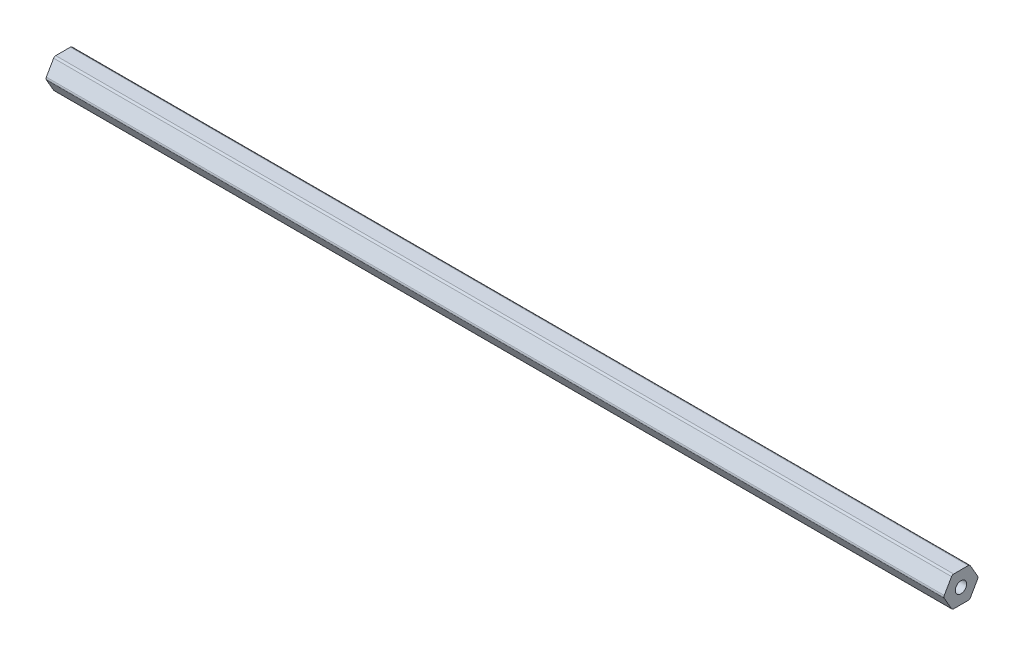
ISO-10303-21;
HEADER;
FILE_DESCRIPTION(('STEP AP214'),'2;1');
FILE_NAME('part.step','',(''),(''),'','','');
FILE_SCHEMA(('AUTOMOTIVE_DESIGN { 1 0 10303 214 1 1 1 1 }'));
ENDSEC;
DATA;
#1=APPLICATION_CONTEXT('core data for automotive mechanical design processes');
#2=APPLICATION_PROTOCOL_DEFINITION('international standard','automotive_design',2000,#1);
#3=PRODUCT_CONTEXT('',#1,'mechanical');
#4=PRODUCT('Part','Part','',(#3));
#5=PRODUCT_RELATED_PRODUCT_CATEGORY('part','',(#4));
#6=PRODUCT_DEFINITION_FORMATION('','',#4);
#7=PRODUCT_DEFINITION_CONTEXT('part definition',#1,'design');
#8=PRODUCT_DEFINITION('design','',#6,#7);
#9=PRODUCT_DEFINITION_SHAPE('','',#8);
#10=(LENGTH_UNIT() NAMED_UNIT(*) SI_UNIT(.MILLI.,.METRE.));
#11=(NAMED_UNIT(*) PLANE_ANGLE_UNIT() SI_UNIT($,.RADIAN.));
#12=(NAMED_UNIT(*) SI_UNIT($,.STERADIAN.) SOLID_ANGLE_UNIT());
#13=UNCERTAINTY_MEASURE_WITH_UNIT(LENGTH_MEASURE(1.E-05),#10,'distance_accuracy_value','');
#14=(GEOMETRIC_REPRESENTATION_CONTEXT(3) GLOBAL_UNCERTAINTY_ASSIGNED_CONTEXT((#13)) GLOBAL_UNIT_ASSIGNED_CONTEXT((#10,
#11,#12)) REPRESENTATION_CONTEXT('',''));
#15=CARTESIAN_POINT('',(0.,0.,0.));
#16=DIRECTION('',(0.,0.,1.));
#17=DIRECTION('',(1.,0.,0.));
#18=AXIS2_PLACEMENT_3D('',#15,#16,#17);
#19=CARTESIAN_POINT('',(377.825,5.334,-3.07958633585748));
#20=DIRECTION('',(-1.,0.,0.));
#21=DIRECTION('',(0.,0.,1.));
#22=AXIS2_PLACEMENT_3D('',#19,#20,#21);
#23=PLANE('',#22);
#24=CARTESIAN_POINT('',(377.825,5.334,-3.07958633585748));
#25=DIRECTION('',(1.,0.,0.));
#26=DIRECTION('',(0.,0.,1.));
#27=AXIS2_PLACEMENT_3D('',#24,#25,#26);
#28=CIRCLE('',#27,1.016);
#29=CARTESIAN_POINT('',(377.825,5.84199999999999,-3.95946814610247));
#30=VERTEX_POINT('',#29);
#31=CARTESIAN_POINT('',(377.825,6.34999999999999,-3.07958633585748));
#32=VERTEX_POINT('',#31);
#33=EDGE_CURVE('E206',#30,#32,#28,.T.);
#34=ORIENTED_EDGE('',*,*,#33,.T.);
#35=DIRECTION('',(0.,0.,1.));
#36=VECTOR('',#35,1.);
#37=CARTESIAN_POINT('',(377.825,6.34999999999999,-3.07958633585748));
#38=LINE('',#37,#36);
#39=CARTESIAN_POINT('',(377.825,6.35000000000001,3.07958633585745));
#40=VERTEX_POINT('',#39);
#41=EDGE_CURVE('E118',#32,#40,#38,.T.);
#42=ORIENTED_EDGE('',*,*,#41,.T.);
#43=CARTESIAN_POINT('',(377.825,5.33400000000001,3.07958633585745));
#44=DIRECTION('',(1.,0.,0.));
#45=DIRECTION('',(0.,0.,1.));
#46=AXIS2_PLACEMENT_3D('',#43,#44,#45);
#47=CIRCLE('',#46,1.016);
#48=CARTESIAN_POINT('',(377.825,5.84200000000001,3.95946814610244));
#49=VERTEX_POINT('',#48);
#50=EDGE_CURVE('E243',#40,#49,#47,.T.);
#51=ORIENTED_EDGE('',*,*,#50,.T.);
#52=DIRECTION('',(0.,-0.866025403784437,0.500000000000003));
#53=VECTOR('',#52,1.);
#54=CARTESIAN_POINT('',(377.825,5.84200000000001,3.95946814610244));
#55=LINE('',#54,#53);
#56=CARTESIAN_POINT('',(377.825,0.508000000000022,7.03905448195992));
#57=VERTEX_POINT('',#56);
#58=EDGE_CURVE('E263',#49,#57,#55,.T.);
#59=ORIENTED_EDGE('',*,*,#58,.T.);
#60=CARTESIAN_POINT('',(377.825,0.,6.15917267171493));
#61=DIRECTION('',(1.,0.,0.));
#62=DIRECTION('',(0.,0.,1.));
#63=AXIS2_PLACEMENT_3D('',#60,#61,#62);
#64=CIRCLE('',#63,1.016);
#65=CARTESIAN_POINT('',(377.825,-0.50799999999998,7.03905448195993));
#66=VERTEX_POINT('',#65);
#67=EDGE_CURVE('E259',#57,#66,#64,.T.);
#68=ORIENTED_EDGE('',*,*,#67,.T.);
#69=DIRECTION('',(0.,-0.86602540378444,-0.499999999999998));
#70=VECTOR('',#69,1.);
#71=CARTESIAN_POINT('',(377.825,-0.507999999999979,7.03905448195992));
#72=LINE('',#71,#70);
#73=CARTESIAN_POINT('',(377.825,-5.84199999999999,3.95946814610247));
#74=VERTEX_POINT('',#73);
#75=EDGE_CURVE('E262',#66,#74,#72,.T.);
#76=ORIENTED_EDGE('',*,*,#75,.T.);
#77=CARTESIAN_POINT('',(377.825,-5.334,3.07958633585748));
#78=DIRECTION('',(1.,0.,0.));
#79=DIRECTION('',(0.,0.,1.));
#80=AXIS2_PLACEMENT_3D('',#77,#78,#79);
#81=CIRCLE('',#80,1.016);
#82=CARTESIAN_POINT('',(377.825,-6.35,3.07958633585748));
#83=VERTEX_POINT('',#82);
#84=EDGE_CURVE('E267',#74,#83,#81,.T.);
#85=ORIENTED_EDGE('',*,*,#84,.T.);
#86=DIRECTION('',(0.,0.,-1.));
#87=VECTOR('',#86,1.);
#88=CARTESIAN_POINT('',(377.825,-6.35,3.07958633585748));
#89=LINE('',#88,#87);
#90=CARTESIAN_POINT('',(377.825,-6.35000000000001,-3.07958633585745));
#91=VERTEX_POINT('',#90);
#92=EDGE_CURVE('E274',#83,#91,#89,.T.);
#93=ORIENTED_EDGE('',*,*,#92,.T.);
#94=CARTESIAN_POINT('',(377.825,-5.33400000000001,-3.07958633585745));
#95=DIRECTION('',(1.,0.,0.));
#96=DIRECTION('',(0.,0.,1.));
#97=AXIS2_PLACEMENT_3D('',#94,#95,#96);
#98=CIRCLE('',#97,1.016);
#99=CARTESIAN_POINT('',(377.825,-5.84200000000001,-3.95946814610244));
#100=VERTEX_POINT('',#99);
#101=EDGE_CURVE('E149',#91,#100,#98,.T.);
#102=ORIENTED_EDGE('',*,*,#101,.T.);
#103=DIRECTION('',(0.,0.866025403784437,-0.500000000000002));
#104=VECTOR('',#103,1.);
#105=CARTESIAN_POINT('',(377.825,-5.84200000000001,-3.95946814610244));
#106=LINE('',#105,#104);
#107=CARTESIAN_POINT('',(377.825,-0.508000000000019,-7.03905448195992));
#108=VERTEX_POINT('',#107);
#109=EDGE_CURVE('E143',#100,#108,#106,.T.);
#110=ORIENTED_EDGE('',*,*,#109,.T.);
#111=CARTESIAN_POINT('',(377.825,0.,-6.15917267171493));
#112=DIRECTION('',(1.,0.,0.));
#113=DIRECTION('',(0.,0.,1.));
#114=AXIS2_PLACEMENT_3D('',#111,#112,#113);
#115=CIRCLE('',#114,1.016);
#116=CARTESIAN_POINT('',(377.825,0.507999999999981,-7.03905448195992));
#117=VERTEX_POINT('',#116);
#118=EDGE_CURVE('E147',#108,#117,#115,.T.);
#119=ORIENTED_EDGE('',*,*,#118,.T.);
#120=DIRECTION('',(0.,0.86602540378444,0.499999999999997));
#121=VECTOR('',#120,1.);
#122=CARTESIAN_POINT('',(377.825,0.50799999999998,-7.03905448195992));
#123=LINE('',#122,#121);
#124=EDGE_CURVE('E63',#117,#30,#123,.T.);
#125=ORIENTED_EDGE('',*,*,#124,.T.);
#126=EDGE_LOOP('',(#34,#42,#51,#59,#68,#76,#85,#93,#102,#110,#119,#125));
#127=FACE_BOUND('',#126,.T.);
#128=CARTESIAN_POINT('',(377.825,0.,0.));
#129=DIRECTION('',(1.,0.,0.));
#130=DIRECTION('',(0.,0.,-1.));
#131=AXIS2_PLACEMENT_3D('',#128,#129,#130);
#132=CIRCLE('',#131,2.38125);
#133=CARTESIAN_POINT('',(377.825,0.,-2.38125));
#134=VERTEX_POINT('',#133);
#135=EDGE_CURVE('E176',#134,#134,#132,.T.);
#136=ORIENTED_EDGE('',*,*,#135,.F.);
#137=EDGE_LOOP('',(#136));
#138=FACE_BOUND('',#137,.T.);
#139=ADVANCED_FACE('F45',(#127,#138),#23,.F.);
#140=CARTESIAN_POINT('',(0.,5.334,-3.07958633585748));
#141=DIRECTION('',(-1.,0.,0.));
#142=DIRECTION('',(0.,0.,1.));
#143=AXIS2_PLACEMENT_3D('',#140,#141,#142);
#144=PLANE('',#143);
#145=CARTESIAN_POINT('',(0.,5.334,-3.07958633585748));
#146=DIRECTION('',(1.,0.,0.));
#147=DIRECTION('',(0.,0.,1.));
#148=AXIS2_PLACEMENT_3D('',#145,#146,#147);
#149=CIRCLE('',#148,1.016);
#150=CARTESIAN_POINT('',(0.,5.84199999999999,-3.95946814610247));
#151=VERTEX_POINT('',#150);
#152=CARTESIAN_POINT('',(0.,6.34999999999999,-3.07958633585748));
#153=VERTEX_POINT('',#152);
#154=EDGE_CURVE('E171',#151,#153,#149,.T.);
#155=ORIENTED_EDGE('',*,*,#154,.F.);
#156=DIRECTION('',(0.,0.86602540378444,0.499999999999997));
#157=VECTOR('',#156,1.);
#158=CARTESIAN_POINT('',(0.,0.50799999999998,-7.03905448195992));
#159=LINE('',#158,#157);
#160=CARTESIAN_POINT('',(0.,0.507999999999981,-7.03905448195992));
#161=VERTEX_POINT('',#160);
#162=EDGE_CURVE('E110',#161,#151,#159,.T.);
#163=ORIENTED_EDGE('',*,*,#162,.F.);
#164=CARTESIAN_POINT('',(0.,0.,-6.15917267171493));
#165=DIRECTION('',(1.,0.,0.));
#166=DIRECTION('',(0.,0.,1.));
#167=AXIS2_PLACEMENT_3D('',#164,#165,#166);
#168=CIRCLE('',#167,1.016);
#169=CARTESIAN_POINT('',(0.,-0.508000000000019,-7.03905448195992));
#170=VERTEX_POINT('',#169);
#171=EDGE_CURVE('E104',#170,#161,#168,.T.);
#172=ORIENTED_EDGE('',*,*,#171,.F.);
#173=DIRECTION('',(0.,0.866025403784437,-0.500000000000002));
#174=VECTOR('',#173,1.);
#175=CARTESIAN_POINT('',(0.,-5.84200000000001,-3.95946814610244));
#176=LINE('',#175,#174);
#177=CARTESIAN_POINT('',(0.,-5.84200000000001,-3.95946814610244));
#178=VERTEX_POINT('',#177);
#179=EDGE_CURVE('E158',#178,#170,#176,.T.);
#180=ORIENTED_EDGE('',*,*,#179,.F.);
#181=CARTESIAN_POINT('',(0.,-5.33400000000001,-3.07958633585745));
#182=DIRECTION('',(1.,0.,0.));
#183=DIRECTION('',(0.,0.,1.));
#184=AXIS2_PLACEMENT_3D('',#181,#182,#183);
#185=CIRCLE('',#184,1.016);
#186=CARTESIAN_POINT('',(0.,-6.35000000000001,-3.07958633585745));
#187=VERTEX_POINT('',#186);
#188=EDGE_CURVE('E197',#187,#178,#185,.T.);
#189=ORIENTED_EDGE('',*,*,#188,.F.);
#190=DIRECTION('',(0.,0.,-1.));
#191=VECTOR('',#190,1.);
#192=CARTESIAN_POINT('',(0.,-6.35,3.07958633585748));
#193=LINE('',#192,#191);
#194=CARTESIAN_POINT('',(0.,-6.35,3.07958633585748));
#195=VERTEX_POINT('',#194);
#196=EDGE_CURVE('E194',#195,#187,#193,.T.);
#197=ORIENTED_EDGE('',*,*,#196,.F.);
#198=CARTESIAN_POINT('',(0.,-5.334,3.07958633585748));
#199=DIRECTION('',(1.,0.,0.));
#200=DIRECTION('',(0.,0.,1.));
#201=AXIS2_PLACEMENT_3D('',#198,#199,#200);
#202=CIRCLE('',#201,1.016);
#203=CARTESIAN_POINT('',(0.,-5.84199999999999,3.95946814610247));
#204=VERTEX_POINT('',#203);
#205=EDGE_CURVE('E191',#204,#195,#202,.T.);
#206=ORIENTED_EDGE('',*,*,#205,.F.);
#207=DIRECTION('',(0.,-0.86602540378444,-0.499999999999998));
#208=VECTOR('',#207,1.);
#209=CARTESIAN_POINT('',(0.,-0.507999999999979,7.03905448195992));
#210=LINE('',#209,#208);
#211=CARTESIAN_POINT('',(0.,-0.50799999999998,7.03905448195993));
#212=VERTEX_POINT('',#211);
#213=EDGE_CURVE('E188',#212,#204,#210,.T.);
#214=ORIENTED_EDGE('',*,*,#213,.F.);
#215=CARTESIAN_POINT('',(0.,0.,6.15917267171493));
#216=DIRECTION('',(1.,0.,0.));
#217=DIRECTION('',(0.,0.,1.));
#218=AXIS2_PLACEMENT_3D('',#215,#216,#217);
#219=CIRCLE('',#218,1.016);
#220=CARTESIAN_POINT('',(0.,0.508000000000022,7.03905448195992));
#221=VERTEX_POINT('',#220);
#222=EDGE_CURVE('E185',#221,#212,#219,.T.);
#223=ORIENTED_EDGE('',*,*,#222,.F.);
#224=DIRECTION('',(0.,-0.866025403784437,0.500000000000003));
#225=VECTOR('',#224,1.);
#226=CARTESIAN_POINT('',(0.,5.84200000000001,3.95946814610244));
#227=LINE('',#226,#225);
#228=CARTESIAN_POINT('',(0.,5.84200000000001,3.95946814610244));
#229=VERTEX_POINT('',#228);
#230=EDGE_CURVE('E182',#229,#221,#227,.T.);
#231=ORIENTED_EDGE('',*,*,#230,.F.);
#232=CARTESIAN_POINT('',(0.,5.33400000000001,3.07958633585745));
#233=DIRECTION('',(1.,0.,0.));
#234=DIRECTION('',(0.,0.,1.));
#235=AXIS2_PLACEMENT_3D('',#232,#233,#234);
#236=CIRCLE('',#235,1.016);
#237=CARTESIAN_POINT('',(0.,6.35000000000001,3.07958633585745));
#238=VERTEX_POINT('',#237);
#239=EDGE_CURVE('E179',#238,#229,#236,.T.);
#240=ORIENTED_EDGE('',*,*,#239,.F.);
#241=DIRECTION('',(0.,0.,1.));
#242=VECTOR('',#241,1.);
#243=CARTESIAN_POINT('',(0.,6.34999999999999,-3.07958633585748));
#244=LINE('',#243,#242);
#245=EDGE_CURVE('E175',#153,#238,#244,.T.);
#246=ORIENTED_EDGE('',*,*,#245,.F.);
#247=EDGE_LOOP('',(#155,#163,#172,#180,#189,#197,#206,#214,#223,#231,#240,#246));
#248=FACE_BOUND('',#247,.T.);
#249=CARTESIAN_POINT('',(0.,0.,0.));
#250=DIRECTION('',(1.,0.,0.));
#251=DIRECTION('',(0.,0.,-1.));
#252=AXIS2_PLACEMENT_3D('',#249,#250,#251);
#253=CIRCLE('',#252,2.38125);
#254=CARTESIAN_POINT('',(0.,0.,-2.38125));
#255=VERTEX_POINT('',#254);
#256=EDGE_CURVE('E474',#255,#255,#253,.T.);
#257=ORIENTED_EDGE('',*,*,#256,.T.);
#258=EDGE_LOOP('',(#257));
#259=FACE_BOUND('',#258,.T.);
#260=ADVANCED_FACE('F247',(#248,#259),#144,.T.);
#261=CARTESIAN_POINT('',(377.825,5.334,-3.07958633585748));
#262=DIRECTION('',(-1.,0.,0.));
#263=DIRECTION('',(0.,0.,1.));
#264=AXIS2_PLACEMENT_3D('',#261,#262,#263);
#265=CYLINDRICAL_SURFACE('',#264,1.016);
#266=ORIENTED_EDGE('',*,*,#154,.T.);
#267=DIRECTION('',(-1.,0.,0.));
#268=VECTOR('',#267,1.);
#269=CARTESIAN_POINT('',(377.825,6.34999999999999,-3.07958633585748));
#270=LINE('',#269,#268);
#271=EDGE_CURVE('E11',#32,#153,#270,.T.);
#272=ORIENTED_EDGE('',*,*,#271,.F.);
#273=ORIENTED_EDGE('',*,*,#33,.F.);
#274=DIRECTION('',(-1.,0.,0.));
#275=VECTOR('',#274,1.);
#276=CARTESIAN_POINT('',(377.825,5.84199999999999,-3.95946814610247));
#277=LINE('',#276,#275);
#278=EDGE_CURVE('E167',#30,#151,#277,.T.);
#279=ORIENTED_EDGE('',*,*,#278,.T.);
#280=EDGE_LOOP('',(#266,#272,#273,#279));
#281=FACE_BOUND('',#280,.T.);
#282=ADVANCED_FACE('F47',(#281),#265,.T.);
#283=CARTESIAN_POINT('',(377.825,6.34999999999999,-3.07958633585748));
#284=DIRECTION('',(0.,-1.,0.));
#285=DIRECTION('',(0.,0.,-1.));
#286=AXIS2_PLACEMENT_3D('',#283,#284,#285);
#287=PLANE('',#286);
#288=ORIENTED_EDGE('',*,*,#245,.T.);
#289=DIRECTION('',(-1.,0.,0.));
#290=VECTOR('',#289,1.);
#291=CARTESIAN_POINT('',(377.825,6.35000000000001,3.07958633585745));
#292=LINE('',#291,#290);
#293=EDGE_CURVE('E55',#40,#238,#292,.T.);
#294=ORIENTED_EDGE('',*,*,#293,.F.);
#295=ORIENTED_EDGE('',*,*,#41,.F.);
#296=ORIENTED_EDGE('',*,*,#271,.T.);
#297=EDGE_LOOP('',(#288,#294,#295,#296));
#298=FACE_BOUND('',#297,.T.);
#299=ADVANCED_FACE('F310',(#298),#287,.F.);
#300=CARTESIAN_POINT('',(377.825,5.33400000000001,3.07958633585745));
#301=DIRECTION('',(-1.,0.,0.));
#302=DIRECTION('',(0.,0.,1.));
#303=AXIS2_PLACEMENT_3D('',#300,#301,#302);
#304=CYLINDRICAL_SURFACE('',#303,1.016);
#305=ORIENTED_EDGE('',*,*,#239,.T.);
#306=DIRECTION('',(-1.,0.,0.));
#307=VECTOR('',#306,1.);
#308=CARTESIAN_POINT('',(377.825,5.84200000000001,3.95946814610244));
#309=LINE('',#308,#307);
#310=EDGE_CURVE('E233',#49,#229,#309,.T.);
#311=ORIENTED_EDGE('',*,*,#310,.F.);
#312=ORIENTED_EDGE('',*,*,#50,.F.);
#313=ORIENTED_EDGE('',*,*,#293,.T.);
#314=EDGE_LOOP('',(#305,#311,#312,#313));
#315=FACE_BOUND('',#314,.T.);
#316=ADVANCED_FACE('F241',(#315),#304,.T.);
#317=CARTESIAN_POINT('',(377.825,5.84200000000001,3.95946814610244));
#318=DIRECTION('',(0.,-0.500000000000003,-0.866025403784437));
#319=DIRECTION('',(0.,0.866025403784437,-0.500000000000003));
#320=AXIS2_PLACEMENT_3D('',#317,#318,#319);
#321=PLANE('',#320);
#322=ORIENTED_EDGE('',*,*,#230,.T.);
#323=DIRECTION('',(-1.,0.,0.));
#324=VECTOR('',#323,1.);
#325=CARTESIAN_POINT('',(377.825,0.508000000000022,7.03905448195992));
#326=LINE('',#325,#324);
#327=EDGE_CURVE('E229',#57,#221,#326,.T.);
#328=ORIENTED_EDGE('',*,*,#327,.F.);
#329=ORIENTED_EDGE('',*,*,#58,.F.);
#330=ORIENTED_EDGE('',*,*,#310,.T.);
#331=EDGE_LOOP('',(#322,#328,#329,#330));
#332=FACE_BOUND('',#331,.T.);
#333=ADVANCED_FACE('F253',(#332),#321,.F.);
#334=CARTESIAN_POINT('',(377.825,0.,6.15917267171493));
#335=DIRECTION('',(-1.,0.,0.));
#336=DIRECTION('',(0.,0.,1.));
#337=AXIS2_PLACEMENT_3D('',#334,#335,#336);
#338=CYLINDRICAL_SURFACE('',#337,1.016);
#339=ORIENTED_EDGE('',*,*,#222,.T.);
#340=DIRECTION('',(-1.,0.,0.));
#341=VECTOR('',#340,1.);
#342=CARTESIAN_POINT('',(377.825,-0.50799999999998,7.03905448195993));
#343=LINE('',#342,#341);
#344=EDGE_CURVE('E225',#66,#212,#343,.T.);
#345=ORIENTED_EDGE('',*,*,#344,.F.);
#346=ORIENTED_EDGE('',*,*,#67,.F.);
#347=ORIENTED_EDGE('',*,*,#327,.T.);
#348=EDGE_LOOP('',(#339,#345,#346,#347));
#349=FACE_BOUND('',#348,.T.);
#350=ADVANCED_FACE('F257',(#349),#338,.T.);
#351=CARTESIAN_POINT('',(377.825,-0.507999999999979,7.03905448195992));
#352=DIRECTION('',(0.,0.499999999999998,-0.86602540378444));
#353=DIRECTION('',(0.,0.86602540378444,0.499999999999998));
#354=AXIS2_PLACEMENT_3D('',#351,#352,#353);
#355=PLANE('',#354);
#356=ORIENTED_EDGE('',*,*,#213,.T.);
#357=DIRECTION('',(-1.,0.,0.));
#358=VECTOR('',#357,1.);
#359=CARTESIAN_POINT('',(377.825,-5.84199999999999,3.95946814610247));
#360=LINE('',#359,#358);
#361=EDGE_CURVE('E221',#74,#204,#360,.T.);
#362=ORIENTED_EDGE('',*,*,#361,.F.);
#363=ORIENTED_EDGE('',*,*,#75,.F.);
#364=ORIENTED_EDGE('',*,*,#344,.T.);
#365=EDGE_LOOP('',(#356,#362,#363,#364));
#366=FACE_BOUND('',#365,.T.);
#367=ADVANCED_FACE('F323',(#366),#355,.F.);
#368=CARTESIAN_POINT('',(377.825,-5.334,3.07958633585748));
#369=DIRECTION('',(-1.,0.,0.));
#370=DIRECTION('',(0.,0.,1.));
#371=AXIS2_PLACEMENT_3D('',#368,#369,#370);
#372=CYLINDRICAL_SURFACE('',#371,1.016);
#373=ORIENTED_EDGE('',*,*,#205,.T.);
#374=DIRECTION('',(-1.,0.,0.));
#375=VECTOR('',#374,1.);
#376=CARTESIAN_POINT('',(377.825,-6.35,3.07958633585748));
#377=LINE('',#376,#375);
#378=EDGE_CURVE('E217',#83,#195,#377,.T.);
#379=ORIENTED_EDGE('',*,*,#378,.F.);
#380=ORIENTED_EDGE('',*,*,#84,.F.);
#381=ORIENTED_EDGE('',*,*,#361,.T.);
#382=EDGE_LOOP('',(#373,#379,#380,#381));
#383=FACE_BOUND('',#382,.T.);
#384=ADVANCED_FACE('F326',(#383),#372,.T.);
#385=CARTESIAN_POINT('',(377.825,-6.35,3.07958633585748));
#386=DIRECTION('',(0.,1.,0.));
#387=DIRECTION('',(0.,0.,1.));
#388=AXIS2_PLACEMENT_3D('',#385,#386,#387);
#389=PLANE('',#388);
#390=ORIENTED_EDGE('',*,*,#196,.T.);
#391=DIRECTION('',(-1.,0.,0.));
#392=VECTOR('',#391,1.);
#393=CARTESIAN_POINT('',(377.825,-6.35000000000001,-3.07958633585745));
#394=LINE('',#393,#392);
#395=EDGE_CURVE('E213',#91,#187,#394,.T.);
#396=ORIENTED_EDGE('',*,*,#395,.F.);
#397=ORIENTED_EDGE('',*,*,#92,.F.);
#398=ORIENTED_EDGE('',*,*,#378,.T.);
#399=EDGE_LOOP('',(#390,#396,#397,#398));
#400=FACE_BOUND('',#399,.T.);
#401=ADVANCED_FACE('F282',(#400),#389,.F.);
#402=CARTESIAN_POINT('',(377.825,-5.33400000000001,-3.07958633585745));
#403=DIRECTION('',(-1.,0.,0.));
#404=DIRECTION('',(0.,0.,1.));
#405=AXIS2_PLACEMENT_3D('',#402,#403,#404);
#406=CYLINDRICAL_SURFACE('',#405,1.016);
#407=ORIENTED_EDGE('',*,*,#188,.T.);
#408=DIRECTION('',(-1.,0.,0.));
#409=VECTOR('',#408,1.);
#410=CARTESIAN_POINT('',(377.825,-5.84200000000001,-3.95946814610244));
#411=LINE('',#410,#409);
#412=EDGE_CURVE('E160',#100,#178,#411,.T.);
#413=ORIENTED_EDGE('',*,*,#412,.F.);
#414=ORIENTED_EDGE('',*,*,#101,.F.);
#415=ORIENTED_EDGE('',*,*,#395,.T.);
#416=EDGE_LOOP('',(#407,#413,#414,#415));
#417=FACE_BOUND('',#416,.T.);
#418=ADVANCED_FACE('F286',(#417),#406,.T.);
#419=CARTESIAN_POINT('',(377.825,-5.84200000000001,-3.95946814610244));
#420=DIRECTION('',(0.,0.500000000000002,0.866025403784437));
#421=DIRECTION('',(0.,-0.866025403784437,0.500000000000002));
#422=AXIS2_PLACEMENT_3D('',#419,#420,#421);
#423=PLANE('',#422);
#424=ORIENTED_EDGE('',*,*,#179,.T.);
#425=DIRECTION('',(-1.,0.,0.));
#426=VECTOR('',#425,1.);
#427=CARTESIAN_POINT('',(377.825,-0.508000000000019,-7.03905448195992));
#428=LINE('',#427,#426);
#429=EDGE_CURVE('E155',#108,#170,#428,.T.);
#430=ORIENTED_EDGE('',*,*,#429,.F.);
#431=ORIENTED_EDGE('',*,*,#109,.F.);
#432=ORIENTED_EDGE('',*,*,#412,.T.);
#433=EDGE_LOOP('',(#424,#430,#431,#432));
#434=FACE_BOUND('',#433,.T.);
#435=ADVANCED_FACE('F156',(#434),#423,.F.);
#436=CARTESIAN_POINT('',(377.825,0.,-6.15917267171493));
#437=DIRECTION('',(-1.,0.,0.));
#438=DIRECTION('',(0.,0.,1.));
#439=AXIS2_PLACEMENT_3D('',#436,#437,#438);
#440=CYLINDRICAL_SURFACE('',#439,1.016);
#441=ORIENTED_EDGE('',*,*,#171,.T.);
#442=DIRECTION('',(-1.,0.,0.));
#443=VECTOR('',#442,1.);
#444=CARTESIAN_POINT('',(377.825,0.507999999999981,-7.03905448195992));
#445=LINE('',#444,#443);
#446=EDGE_CURVE('E161',#117,#161,#445,.T.);
#447=ORIENTED_EDGE('',*,*,#446,.F.);
#448=ORIENTED_EDGE('',*,*,#118,.F.);
#449=ORIENTED_EDGE('',*,*,#429,.T.);
#450=EDGE_LOOP('',(#441,#447,#448,#449));
#451=FACE_BOUND('',#450,.T.);
#452=ADVANCED_FACE('F163',(#451),#440,.T.);
#453=CARTESIAN_POINT('',(377.825,0.50799999999998,-7.03905448195992));
#454=DIRECTION('',(0.,-0.499999999999997,0.86602540378444));
#455=DIRECTION('',(0.,-0.86602540378444,-0.499999999999997));
#456=AXIS2_PLACEMENT_3D('',#453,#454,#455);
#457=PLANE('',#456);
#458=ORIENTED_EDGE('',*,*,#162,.T.);
#459=ORIENTED_EDGE('',*,*,#278,.F.);
#460=ORIENTED_EDGE('',*,*,#124,.F.);
#461=ORIENTED_EDGE('',*,*,#446,.T.);
#462=EDGE_LOOP('',(#458,#459,#460,#461));
#463=FACE_BOUND('',#462,.T.);
#464=ADVANCED_FACE('F290',(#463),#457,.F.);
#465=CARTESIAN_POINT('',(377.825,0.,0.));
#466=DIRECTION('',(-1.,0.,0.));
#467=DIRECTION('',(0.,0.,1.));
#468=AXIS2_PLACEMENT_3D('',#465,#466,#467);
#469=CYLINDRICAL_SURFACE('',#468,2.38125);
#470=ORIENTED_EDGE('',*,*,#135,.T.);
#471=EDGE_LOOP('',(#470));
#472=FACE_BOUND('',#471,.T.);
#473=ORIENTED_EDGE('',*,*,#256,.F.);
#474=EDGE_LOOP('',(#473));
#475=FACE_BOUND('',#474,.T.);
#476=ADVANCED_FACE('F292',(#472,#475),#469,.F.);
#477=CLOSED_SHELL('',(#139,#260,#282,#299,#316,#333,#350,#367,#384,#401,#418,#435,#452,#464,#476));
#478=MANIFOLD_SOLID_BREP('B2',#477);
#479=ADVANCED_BREP_SHAPE_REPRESENTATION('',(#18,#478),#14);
#480=SHAPE_DEFINITION_REPRESENTATION(#9,#479);
ENDSEC;
END-ISO-10303-21;
